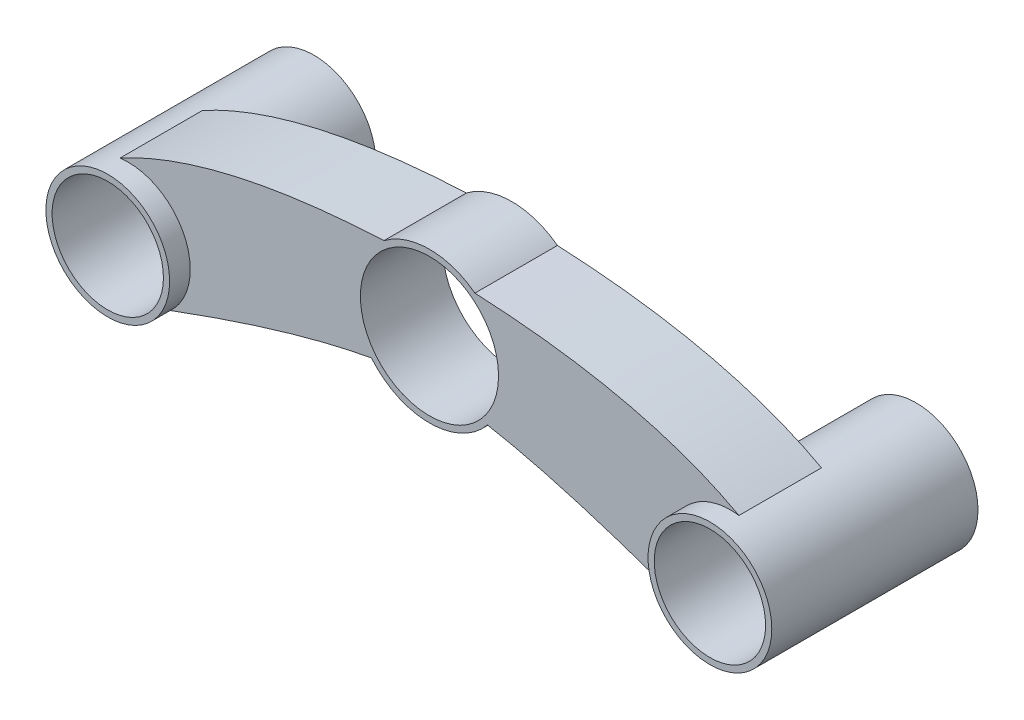
ISO-10303-21;
HEADER;
FILE_DESCRIPTION(('STEP AP214'),'2;1');
FILE_NAME('part.step','',(''),(''),'','','');
FILE_SCHEMA(('AUTOMOTIVE_DESIGN { 1 0 10303 214 1 1 1 1 }'));
ENDSEC;
DATA;
#1=APPLICATION_CONTEXT('core data for automotive mechanical design processes');
#2=APPLICATION_PROTOCOL_DEFINITION('international standard','automotive_design',2000,#1);
#3=PRODUCT_CONTEXT('',#1,'mechanical');
#4=PRODUCT('Part','Part','',(#3));
#5=PRODUCT_RELATED_PRODUCT_CATEGORY('part','',(#4));
#6=PRODUCT_DEFINITION_FORMATION('','',#4);
#7=PRODUCT_DEFINITION_CONTEXT('part definition',#1,'design');
#8=PRODUCT_DEFINITION('design','',#6,#7);
#9=PRODUCT_DEFINITION_SHAPE('','',#8);
#10=(LENGTH_UNIT() NAMED_UNIT(*) SI_UNIT(.MILLI.,.METRE.));
#11=(NAMED_UNIT(*) PLANE_ANGLE_UNIT() SI_UNIT($,.RADIAN.));
#12=(NAMED_UNIT(*) SI_UNIT($,.STERADIAN.) SOLID_ANGLE_UNIT());
#13=UNCERTAINTY_MEASURE_WITH_UNIT(LENGTH_MEASURE(1.E-05),#10,'distance_accuracy_value','');
#14=(GEOMETRIC_REPRESENTATION_CONTEXT(3) GLOBAL_UNCERTAINTY_ASSIGNED_CONTEXT((#13)) GLOBAL_UNIT_ASSIGNED_CONTEXT((#10,
#11,#12)) REPRESENTATION_CONTEXT('',''));
#15=CARTESIAN_POINT('',(0.,0.,0.));
#16=DIRECTION('',(0.,0.,1.));
#17=DIRECTION('',(1.,0.,0.));
#18=AXIS2_PLACEMENT_3D('',#15,#16,#17);
#19=CARTESIAN_POINT('',(120.37838915768,24.9105220402236,45.));
#20=DIRECTION('',(0.,0.,-1.));
#21=DIRECTION('',(-1.,0.,0.));
#22=AXIS2_PLACEMENT_3D('',#19,#20,#21);
#23=PLANE('',#22);
#24=CARTESIAN_POINT('',(148.041829409571,14.8603813094486,45.));
#25=CARTESIAN_POINT('',(124.7234173012,27.6190888058887,45.));
#26=CARTESIAN_POINT('',(84.0248926187476,29.5435292396682,45.));
#27=B_SPLINE_CURVE_WITH_KNOTS('',2,(#24,#25,#26),.UNSPECIFIED.,.F.,.F.,(3,3),(0.,1.),.UNSPECIFIED.);
#28=CARTESIAN_POINT('',(148.041829409571,14.8603813094486,45.));
#29=VERTEX_POINT('',#28);
#30=CARTESIAN_POINT('',(84.0248926187476,29.5435292396682,45.));
#31=VERTEX_POINT('',#30);
#32=EDGE_CURVE('E215',#29,#31,#27,.T.);
#33=ORIENTED_EDGE('',*,*,#32,.T.);
#34=CARTESIAN_POINT('',(73.,15.,45.));
#35=DIRECTION('',(0.,0.,1.));
#36=DIRECTION('',(1.,0.,0.));
#37=AXIS2_PLACEMENT_3D('',#34,#35,#36);
#38=CIRCLE('',#37,18.25);
#39=CARTESIAN_POINT('',(61.9751073812524,29.5435292396682,45.));
#40=VERTEX_POINT('',#39);
#41=EDGE_CURVE('E107',#31,#40,#38,.T.);
#42=ORIENTED_EDGE('',*,*,#41,.T.);
#43=CARTESIAN_POINT('',(61.9751073812524,29.5435292396682,45.));
#44=CARTESIAN_POINT('',(21.2765826988004,27.6190888058887,45.));
#45=CARTESIAN_POINT('',(-2.04182940957121,14.8603813094486,45.));
#46=B_SPLINE_CURVE_WITH_KNOTS('',2,(#43,#44,#45),.UNSPECIFIED.,.F.,.F.,(3,3),(0.,1.),.UNSPECIFIED.);
#47=CARTESIAN_POINT('',(-2.04182940957121,14.8603813094486,45.));
#48=VERTEX_POINT('',#47);
#49=EDGE_CURVE('E173',#40,#48,#46,.T.);
#50=ORIENTED_EDGE('',*,*,#49,.T.);
#51=CARTESIAN_POINT('',(0.,0.,45.));
#52=DIRECTION('',(0.,0.,-1.));
#53=DIRECTION('',(1.,0.,0.));
#54=AXIS2_PLACEMENT_3D('',#51,#52,#53);
#55=CIRCLE('',#54,15.);
#56=CARTESIAN_POINT('',(10.1419257855149,-11.0517573879048,45.));
#57=VERTEX_POINT('',#56);
#58=EDGE_CURVE('E168',#48,#57,#55,.T.);
#59=ORIENTED_EDGE('',*,*,#58,.T.);
#60=CARTESIAN_POINT('',(10.1419257855149,-11.0517573879048,45.));
#61=CARTESIAN_POINT('',(39.606342857875,-0.108887447388188,45.));
#62=CARTESIAN_POINT('',(58.9300484309368,3.37679205880679,45.));
#63=B_SPLINE_CURVE_WITH_KNOTS('',2,(#60,#61,#62),.UNSPECIFIED.,.F.,.F.,(3,3),(0.,1.),.UNSPECIFIED.);
#64=CARTESIAN_POINT('',(58.9300484309368,3.37679205880679,45.));
#65=VERTEX_POINT('',#64);
#66=EDGE_CURVE('E126',#57,#65,#63,.T.);
#67=ORIENTED_EDGE('',*,*,#66,.T.);
#68=CARTESIAN_POINT('',(73.,15.,45.));
#69=DIRECTION('',(0.,0.,1.));
#70=DIRECTION('',(1.,0.,0.));
#71=AXIS2_PLACEMENT_3D('',#68,#69,#70);
#72=CIRCLE('',#71,18.25);
#73=CARTESIAN_POINT('',(87.0699515690632,3.37679205880679,45.));
#74=VERTEX_POINT('',#73);
#75=EDGE_CURVE('E120',#65,#74,#72,.T.);
#76=ORIENTED_EDGE('',*,*,#75,.T.);
#77=CARTESIAN_POINT('',(87.0699515690632,3.37679205880679,45.));
#78=CARTESIAN_POINT('',(106.393657142125,-0.108887447388181,45.));
#79=CARTESIAN_POINT('',(135.858074214485,-11.0517573879048,45.));
#80=B_SPLINE_CURVE_WITH_KNOTS('',2,(#77,#78,#79),.UNSPECIFIED.,.F.,.F.,(3,3),(0.,1.),.UNSPECIFIED.);
#81=CARTESIAN_POINT('',(135.858074214485,-11.0517573879048,45.));
#82=VERTEX_POINT('',#81);
#83=EDGE_CURVE('E124',#74,#82,#80,.T.);
#84=ORIENTED_EDGE('',*,*,#83,.T.);
#85=CARTESIAN_POINT('',(146.,0.,45.));
#86=DIRECTION('',(0.,0.,-1.));
#87=DIRECTION('',(-1.,0.,0.));
#88=AXIS2_PLACEMENT_3D('',#85,#86,#87);
#89=CIRCLE('',#88,15.);
#90=EDGE_CURVE('E64',#82,#29,#89,.T.);
#91=ORIENTED_EDGE('',*,*,#90,.T.);
#92=EDGE_LOOP('',(#33,#42,#50,#59,#67,#76,#84,#91));
#93=FACE_BOUND('',#92,.T.);
#94=CARTESIAN_POINT('',(73.,15.,45.));
#95=DIRECTION('',(0.,0.,1.));
#96=DIRECTION('',(1.,0.,0.));
#97=AXIS2_PLACEMENT_3D('',#94,#95,#96);
#98=CIRCLE('',#97,16.75);
#99=CARTESIAN_POINT('',(89.75,15.,45.));
#100=VERTEX_POINT('',#99);
#101=EDGE_CURVE('E207',#100,#100,#98,.T.);
#102=ORIENTED_EDGE('',*,*,#101,.F.);
#103=EDGE_LOOP('',(#102));
#104=FACE_BOUND('',#103,.T.);
#105=ADVANCED_FACE('F46',(#93,#104),#23,.F.);
#106=CARTESIAN_POINT('',(120.37838915768,24.9105220402236,25.));
#107=DIRECTION('',(0.,0.,-1.));
#108=DIRECTION('',(-1.,0.,0.));
#109=AXIS2_PLACEMENT_3D('',#106,#107,#108);
#110=PLANE('',#109);
#111=CARTESIAN_POINT('',(148.041829409571,14.8603813094486,25.));
#112=CARTESIAN_POINT('',(124.7234173012,27.6190888058887,25.));
#113=CARTESIAN_POINT('',(84.0248926187476,29.5435292396682,25.));
#114=B_SPLINE_CURVE_WITH_KNOTS('',2,(#111,#112,#113),.UNSPECIFIED.,.F.,.F.,(3,3),(0.,1.),.UNSPECIFIED.);
#115=CARTESIAN_POINT('',(148.041829409571,14.8603813094486,25.));
#116=VERTEX_POINT('',#115);
#117=CARTESIAN_POINT('',(84.0248926187476,29.5435292396682,25.));
#118=VERTEX_POINT('',#117);
#119=EDGE_CURVE('E213',#116,#118,#114,.T.);
#120=ORIENTED_EDGE('',*,*,#119,.F.);
#121=CARTESIAN_POINT('',(146.,0.,25.));
#122=DIRECTION('',(0.,0.,-1.));
#123=DIRECTION('',(-1.,0.,0.));
#124=AXIS2_PLACEMENT_3D('',#121,#122,#123);
#125=CIRCLE('',#124,15.);
#126=CARTESIAN_POINT('',(135.858074214485,-11.0517573879048,25.));
#127=VERTEX_POINT('',#126);
#128=EDGE_CURVE('E99',#127,#116,#125,.T.);
#129=ORIENTED_EDGE('',*,*,#128,.F.);
#130=CARTESIAN_POINT('',(87.0699515690632,3.37679205880679,25.));
#131=CARTESIAN_POINT('',(106.393657142125,-0.108887447388181,25.));
#132=CARTESIAN_POINT('',(135.858074214485,-11.0517573879048,25.));
#133=B_SPLINE_CURVE_WITH_KNOTS('',2,(#130,#131,#132),.UNSPECIFIED.,.F.,.F.,(3,3),(0.,1.),.UNSPECIFIED.);
#134=CARTESIAN_POINT('',(87.0699515690632,3.37679205880679,25.));
#135=VERTEX_POINT('',#134);
#136=EDGE_CURVE('E93',#135,#127,#133,.T.);
#137=ORIENTED_EDGE('',*,*,#136,.F.);
#138=CARTESIAN_POINT('',(73.,15.,25.));
#139=DIRECTION('',(0.,0.,1.));
#140=DIRECTION('',(1.,0.,0.));
#141=AXIS2_PLACEMENT_3D('',#138,#139,#140);
#142=CIRCLE('',#141,18.25);
#143=CARTESIAN_POINT('',(58.9300484309368,3.37679205880679,25.));
#144=VERTEX_POINT('',#143);
#145=EDGE_CURVE('E134',#144,#135,#142,.T.);
#146=ORIENTED_EDGE('',*,*,#145,.F.);
#147=CARTESIAN_POINT('',(10.1419257855149,-11.0517573879048,25.));
#148=CARTESIAN_POINT('',(39.606342857875,-0.108887447388188,25.));
#149=CARTESIAN_POINT('',(58.9300484309368,3.37679205880679,25.));
#150=B_SPLINE_CURVE_WITH_KNOTS('',2,(#147,#148,#149),.UNSPECIFIED.,.F.,.F.,(3,3),(0.,1.),.UNSPECIFIED.);
#151=CARTESIAN_POINT('',(10.1419257855149,-11.0517573879048,25.));
#152=VERTEX_POINT('',#151);
#153=EDGE_CURVE('E249',#152,#144,#150,.T.);
#154=ORIENTED_EDGE('',*,*,#153,.F.);
#155=CARTESIAN_POINT('',(0.,0.,25.));
#156=DIRECTION('',(0.,0.,-1.));
#157=DIRECTION('',(1.,0.,0.));
#158=AXIS2_PLACEMENT_3D('',#155,#156,#157);
#159=CIRCLE('',#158,15.);
#160=CARTESIAN_POINT('',(-2.04182940957121,14.8603813094486,25.));
#161=VERTEX_POINT('',#160);
#162=EDGE_CURVE('E247',#161,#152,#159,.T.);
#163=ORIENTED_EDGE('',*,*,#162,.F.);
#164=CARTESIAN_POINT('',(61.9751073812524,29.5435292396682,25.));
#165=CARTESIAN_POINT('',(21.2765826988004,27.6190888058887,25.));
#166=CARTESIAN_POINT('',(-2.04182940957121,14.8603813094486,25.));
#167=B_SPLINE_CURVE_WITH_KNOTS('',2,(#164,#165,#166),.UNSPECIFIED.,.F.,.F.,(3,3),(0.,1.),.UNSPECIFIED.);
#168=CARTESIAN_POINT('',(61.9751073812524,29.5435292396682,25.));
#169=VERTEX_POINT('',#168);
#170=EDGE_CURVE('E242',#169,#161,#167,.T.);
#171=ORIENTED_EDGE('',*,*,#170,.F.);
#172=CARTESIAN_POINT('',(73.,15.,25.));
#173=DIRECTION('',(0.,0.,1.));
#174=DIRECTION('',(1.,0.,0.));
#175=AXIS2_PLACEMENT_3D('',#172,#173,#174);
#176=CIRCLE('',#175,18.25);
#177=EDGE_CURVE('E245',#118,#169,#176,.T.);
#178=ORIENTED_EDGE('',*,*,#177,.F.);
#179=EDGE_LOOP('',(#120,#129,#137,#146,#154,#163,#171,#178));
#180=FACE_BOUND('',#179,.T.);
#181=CARTESIAN_POINT('',(73.,15.,25.));
#182=DIRECTION('',(0.,0.,1.));
#183=DIRECTION('',(1.,0.,0.));
#184=AXIS2_PLACEMENT_3D('',#181,#182,#183);
#185=CIRCLE('',#184,16.75);
#186=CARTESIAN_POINT('',(89.75,15.,25.));
#187=VERTEX_POINT('',#186);
#188=EDGE_CURVE('E210',#187,#187,#185,.T.);
#189=ORIENTED_EDGE('',*,*,#188,.T.);
#190=EDGE_LOOP('',(#189));
#191=FACE_BOUND('',#190,.T.);
#192=ADVANCED_FACE('F189',(#180,#191),#110,.T.);
#193=DIRECTION('',(0.,0.,-1.));
#194=VECTOR('',#193,1.);
#195=SURFACE_OF_LINEAR_EXTRUSION('',#27,#194);
#196=ORIENTED_EDGE('',*,*,#119,.T.);
#197=DIRECTION('',(0.,0.,-1.));
#198=VECTOR('',#197,1.);
#199=CARTESIAN_POINT('',(84.0248926187476,29.5435292396682,45.));
#200=LINE('',#199,#198);
#201=EDGE_CURVE('E12',#31,#118,#200,.T.);
#202=ORIENTED_EDGE('',*,*,#201,.F.);
#203=ORIENTED_EDGE('',*,*,#32,.F.);
#204=DIRECTION('',(0.,0.,-1.));
#205=VECTOR('',#204,1.);
#206=CARTESIAN_POINT('',(148.041829409571,14.8603813094486,45.));
#207=LINE('',#206,#205);
#208=EDGE_CURVE('E140',#29,#116,#207,.T.);
#209=ORIENTED_EDGE('',*,*,#208,.T.);
#210=EDGE_LOOP('',(#196,#202,#203,#209));
#211=FACE_BOUND('',#210,.T.);
#212=ADVANCED_FACE('F48',(#211),#195,.F.);
#213=CARTESIAN_POINT('',(73.,15.,45.));
#214=DIRECTION('',(0.,0.,-1.));
#215=DIRECTION('',(-1.,0.,0.));
#216=AXIS2_PLACEMENT_3D('',#213,#214,#215);
#217=CYLINDRICAL_SURFACE('',#216,18.25);
#218=ORIENTED_EDGE('',*,*,#177,.T.);
#219=DIRECTION('',(0.,0.,-1.));
#220=VECTOR('',#219,1.);
#221=CARTESIAN_POINT('',(61.9751073812524,29.5435292396682,45.));
#222=LINE('',#221,#220);
#223=EDGE_CURVE('E56',#40,#169,#222,.T.);
#224=ORIENTED_EDGE('',*,*,#223,.F.);
#225=ORIENTED_EDGE('',*,*,#41,.F.);
#226=ORIENTED_EDGE('',*,*,#201,.T.);
#227=EDGE_LOOP('',(#218,#224,#225,#226));
#228=FACE_BOUND('',#227,.T.);
#229=ADVANCED_FACE('F183',(#228),#217,.T.);
#230=DIRECTION('',(0.,0.,-1.));
#231=VECTOR('',#230,1.);
#232=SURFACE_OF_LINEAR_EXTRUSION('',#46,#231);
#233=ORIENTED_EDGE('',*,*,#170,.T.);
#234=DIRECTION('',(0.,0.,-1.));
#235=VECTOR('',#234,1.);
#236=CARTESIAN_POINT('',(-2.04182940957121,14.8603813094486,45.));
#237=LINE('',#236,#235);
#238=EDGE_CURVE('E236',#48,#161,#237,.T.);
#239=ORIENTED_EDGE('',*,*,#238,.F.);
#240=ORIENTED_EDGE('',*,*,#49,.F.);
#241=ORIENTED_EDGE('',*,*,#223,.T.);
#242=EDGE_LOOP('',(#233,#239,#240,#241));
#243=FACE_BOUND('',#242,.T.);
#244=ADVANCED_FACE('F181',(#243),#232,.F.);
#245=CARTESIAN_POINT('',(0.,0.,45.));
#246=DIRECTION('',(0.,0.,-1.));
#247=DIRECTION('',(-1.,0.,0.));
#248=AXIS2_PLACEMENT_3D('',#245,#246,#247);
#249=CYLINDRICAL_SURFACE('',#248,15.);
#250=ORIENTED_EDGE('',*,*,#162,.T.);
#251=DIRECTION('',(0.,0.,-1.));
#252=VECTOR('',#251,1.);
#253=CARTESIAN_POINT('',(10.1419257855149,-11.0517573879048,45.));
#254=LINE('',#253,#252);
#255=EDGE_CURVE('E233',#57,#152,#254,.T.);
#256=ORIENTED_EDGE('',*,*,#255,.F.);
#257=ORIENTED_EDGE('',*,*,#58,.F.);
#258=ORIENTED_EDGE('',*,*,#238,.T.);
#259=EDGE_LOOP('',(#250,#256,#257,#258));
#260=FACE_BOUND('',#259,.T.);
#261=ADVANCED_FACE('F161',(#260),#249,.F.);
#262=DIRECTION('',(0.,0.,-1.));
#263=VECTOR('',#262,1.);
#264=SURFACE_OF_LINEAR_EXTRUSION('',#63,#263);
#265=ORIENTED_EDGE('',*,*,#153,.T.);
#266=DIRECTION('',(0.,0.,-1.));
#267=VECTOR('',#266,1.);
#268=CARTESIAN_POINT('',(58.9300484309368,3.37679205880679,45.));
#269=LINE('',#268,#267);
#270=EDGE_CURVE('E135',#65,#144,#269,.T.);
#271=ORIENTED_EDGE('',*,*,#270,.F.);
#272=ORIENTED_EDGE('',*,*,#66,.F.);
#273=ORIENTED_EDGE('',*,*,#255,.T.);
#274=EDGE_LOOP('',(#265,#271,#272,#273));
#275=FACE_BOUND('',#274,.T.);
#276=ADVANCED_FACE('F158',(#275),#264,.F.);
#277=CARTESIAN_POINT('',(73.,15.,45.));
#278=DIRECTION('',(0.,0.,-1.));
#279=DIRECTION('',(-1.,0.,0.));
#280=AXIS2_PLACEMENT_3D('',#277,#278,#279);
#281=CYLINDRICAL_SURFACE('',#280,18.25);
#282=ORIENTED_EDGE('',*,*,#145,.T.);
#283=DIRECTION('',(0.,0.,-1.));
#284=VECTOR('',#283,1.);
#285=CARTESIAN_POINT('',(87.0699515690632,3.37679205880679,45.));
#286=LINE('',#285,#284);
#287=EDGE_CURVE('E131',#74,#135,#286,.T.);
#288=ORIENTED_EDGE('',*,*,#287,.F.);
#289=ORIENTED_EDGE('',*,*,#75,.F.);
#290=ORIENTED_EDGE('',*,*,#270,.T.);
#291=EDGE_LOOP('',(#282,#288,#289,#290));
#292=FACE_BOUND('',#291,.T.);
#293=ADVANCED_FACE('F132',(#292),#281,.T.);
#294=DIRECTION('',(0.,0.,-1.));
#295=VECTOR('',#294,1.);
#296=SURFACE_OF_LINEAR_EXTRUSION('',#80,#295);
#297=ORIENTED_EDGE('',*,*,#136,.T.);
#298=DIRECTION('',(0.,0.,-1.));
#299=VECTOR('',#298,1.);
#300=CARTESIAN_POINT('',(135.858074214485,-11.0517573879048,45.));
#301=LINE('',#300,#299);
#302=EDGE_CURVE('E136',#82,#127,#301,.T.);
#303=ORIENTED_EDGE('',*,*,#302,.F.);
#304=ORIENTED_EDGE('',*,*,#83,.F.);
#305=ORIENTED_EDGE('',*,*,#287,.T.);
#306=EDGE_LOOP('',(#297,#303,#304,#305));
#307=FACE_BOUND('',#306,.T.);
#308=ADVANCED_FACE('F138',(#307),#296,.F.);
#309=CARTESIAN_POINT('',(146.,0.,45.));
#310=DIRECTION('',(0.,0.,-1.));
#311=DIRECTION('',(-1.,0.,0.));
#312=AXIS2_PLACEMENT_3D('',#309,#310,#311);
#313=CYLINDRICAL_SURFACE('',#312,15.);
#314=ORIENTED_EDGE('',*,*,#128,.T.);
#315=ORIENTED_EDGE('',*,*,#208,.F.);
#316=ORIENTED_EDGE('',*,*,#90,.F.);
#317=ORIENTED_EDGE('',*,*,#302,.T.);
#318=EDGE_LOOP('',(#314,#315,#316,#317));
#319=FACE_BOUND('',#318,.T.);
#320=ADVANCED_FACE('F154',(#319),#313,.F.);
#321=CARTESIAN_POINT('',(73.,15.,45.));
#322=DIRECTION('',(0.,0.,-1.));
#323=DIRECTION('',(-1.,0.,0.));
#324=AXIS2_PLACEMENT_3D('',#321,#322,#323);
#325=CYLINDRICAL_SURFACE('',#324,16.75);
#326=ORIENTED_EDGE('',*,*,#101,.T.);
#327=EDGE_LOOP('',(#326));
#328=FACE_BOUND('',#327,.T.);
#329=ORIENTED_EDGE('',*,*,#188,.F.);
#330=EDGE_LOOP('',(#329));
#331=FACE_BOUND('',#330,.T.);
#332=ADVANCED_FACE('F198',(#328,#331),#325,.F.);
#333=CLOSED_SHELL('',(#105,#192,#212,#229,#244,#261,#276,#293,#308,#320,#332));
#334=MANIFOLD_SOLID_BREP('B2',#333);
#335=CARTESIAN_POINT('',(146.,0.,50.));
#336=DIRECTION('',(0.,0.,1.));
#337=DIRECTION('',(1.,0.,0.));
#338=AXIS2_PLACEMENT_3D('',#335,#336,#337);
#339=PLANE('',#338);
#340=CARTESIAN_POINT('',(146.,0.,50.));
#341=DIRECTION('',(0.,0.,1.));
#342=DIRECTION('',(1.,0.,0.));
#343=AXIS2_PLACEMENT_3D('',#340,#341,#342);
#344=CIRCLE('',#343,15.);
#345=CARTESIAN_POINT('',(161.,0.,50.));
#346=VERTEX_POINT('',#345);
#347=EDGE_CURVE('E381',#346,#346,#344,.T.);
#348=ORIENTED_EDGE('',*,*,#347,.T.);
#349=EDGE_LOOP('',(#348));
#350=FACE_BOUND('',#349,.T.);
#351=CARTESIAN_POINT('',(146.,0.,50.));
#352=DIRECTION('',(0.,0.,1.));
#353=DIRECTION('',(1.,0.,0.));
#354=AXIS2_PLACEMENT_3D('',#351,#352,#353);
#355=CIRCLE('',#354,13.5);
#356=CARTESIAN_POINT('',(159.5,0.,50.));
#357=VERTEX_POINT('',#356);
#358=EDGE_CURVE('E372',#357,#357,#355,.T.);
#359=ORIENTED_EDGE('',*,*,#358,.F.);
#360=EDGE_LOOP('',(#359));
#361=FACE_BOUND('',#360,.T.);
#362=ADVANCED_FACE('F368',(#350,#361),#339,.T.);
#363=CARTESIAN_POINT('',(146.,0.,0.));
#364=DIRECTION('',(0.,0.,1.));
#365=DIRECTION('',(1.,0.,0.));
#366=AXIS2_PLACEMENT_3D('',#363,#364,#365);
#367=PLANE('',#366);
#368=CARTESIAN_POINT('',(146.,0.,0.));
#369=DIRECTION('',(0.,0.,1.));
#370=DIRECTION('',(1.,0.,0.));
#371=AXIS2_PLACEMENT_3D('',#368,#369,#370);
#372=CIRCLE('',#371,15.);
#373=CARTESIAN_POINT('',(161.,0.,0.));
#374=VERTEX_POINT('',#373);
#375=EDGE_CURVE('E379',#374,#374,#372,.T.);
#376=ORIENTED_EDGE('',*,*,#375,.F.);
#377=EDGE_LOOP('',(#376));
#378=FACE_BOUND('',#377,.T.);
#379=CARTESIAN_POINT('',(146.,0.,0.));
#380=DIRECTION('',(0.,0.,1.));
#381=DIRECTION('',(1.,0.,0.));
#382=AXIS2_PLACEMENT_3D('',#379,#380,#381);
#383=CIRCLE('',#382,13.5);
#384=CARTESIAN_POINT('',(159.5,0.,0.));
#385=VERTEX_POINT('',#384);
#386=EDGE_CURVE('E45',#385,#385,#383,.T.);
#387=ORIENTED_EDGE('',*,*,#386,.T.);
#388=EDGE_LOOP('',(#387));
#389=FACE_BOUND('',#388,.T.);
#390=ADVANCED_FACE('F389',(#378,#389),#367,.F.);
#391=CARTESIAN_POINT('',(146.,0.,50.));
#392=DIRECTION('',(0.,0.,-1.));
#393=DIRECTION('',(-1.,0.,0.));
#394=AXIS2_PLACEMENT_3D('',#391,#392,#393);
#395=CYLINDRICAL_SURFACE('',#394,15.);
#396=ORIENTED_EDGE('',*,*,#347,.F.);
#397=EDGE_LOOP('',(#396));
#398=FACE_BOUND('',#397,.T.);
#399=ORIENTED_EDGE('',*,*,#375,.T.);
#400=EDGE_LOOP('',(#399));
#401=FACE_BOUND('',#400,.T.);
#402=ADVANCED_FACE('F387',(#398,#401),#395,.T.);
#403=CARTESIAN_POINT('',(146.,0.,50.));
#404=DIRECTION('',(0.,0.,-1.));
#405=DIRECTION('',(-1.,0.,0.));
#406=AXIS2_PLACEMENT_3D('',#403,#404,#405);
#407=CYLINDRICAL_SURFACE('',#406,13.5);
#408=ORIENTED_EDGE('',*,*,#358,.T.);
#409=EDGE_LOOP('',(#408));
#410=FACE_BOUND('',#409,.T.);
#411=ORIENTED_EDGE('',*,*,#386,.F.);
#412=EDGE_LOOP('',(#411));
#413=FACE_BOUND('',#412,.T.);
#414=ADVANCED_FACE('F370',(#410,#413),#407,.F.);
#415=CLOSED_SHELL('',(#362,#390,#402,#414));
#416=MANIFOLD_SOLID_BREP('B6',#415);
#417=CARTESIAN_POINT('',(0.,0.,50.));
#418=DIRECTION('',(0.,0.,1.));
#419=DIRECTION('',(1.,0.,0.));
#420=AXIS2_PLACEMENT_3D('',#417,#418,#419);
#421=PLANE('',#420);
#422=CARTESIAN_POINT('',(0.,0.,50.));
#423=DIRECTION('',(0.,0.,1.));
#424=DIRECTION('',(1.,0.,0.));
#425=AXIS2_PLACEMENT_3D('',#422,#423,#424);
#426=CIRCLE('',#425,15.);
#427=CARTESIAN_POINT('',(15.,0.,50.));
#428=VERTEX_POINT('',#427);
#429=EDGE_CURVE('E367',#428,#428,#426,.T.);
#430=ORIENTED_EDGE('',*,*,#429,.T.);
#431=EDGE_LOOP('',(#430));
#432=FACE_BOUND('',#431,.T.);
#433=CARTESIAN_POINT('',(0.,0.,50.));
#434=DIRECTION('',(0.,0.,1.));
#435=DIRECTION('',(1.,0.,0.));
#436=AXIS2_PLACEMENT_3D('',#433,#434,#435);
#437=CIRCLE('',#436,13.5);
#438=CARTESIAN_POINT('',(13.5,0.,50.));
#439=VERTEX_POINT('',#438);
#440=EDGE_CURVE('E449',#439,#439,#437,.T.);
#441=ORIENTED_EDGE('',*,*,#440,.F.);
#442=EDGE_LOOP('',(#441));
#443=FACE_BOUND('',#442,.T.);
#444=ADVANCED_FACE('F438',(#432,#443),#421,.T.);
#445=CARTESIAN_POINT('',(0.,0.,0.));
#446=DIRECTION('',(0.,0.,1.));
#447=DIRECTION('',(1.,0.,0.));
#448=AXIS2_PLACEMENT_3D('',#445,#446,#447);
#449=PLANE('',#448);
#450=CARTESIAN_POINT('',(0.,0.,0.));
#451=DIRECTION('',(0.,0.,1.));
#452=DIRECTION('',(1.,0.,0.));
#453=AXIS2_PLACEMENT_3D('',#450,#451,#452);
#454=CIRCLE('',#453,15.);
#455=CARTESIAN_POINT('',(15.,0.,0.));
#456=VERTEX_POINT('',#455);
#457=EDGE_CURVE('E442',#456,#456,#454,.T.);
#458=ORIENTED_EDGE('',*,*,#457,.F.);
#459=EDGE_LOOP('',(#458));
#460=FACE_BOUND('',#459,.T.);
#461=CARTESIAN_POINT('',(0.,0.,0.));
#462=DIRECTION('',(0.,0.,1.));
#463=DIRECTION('',(1.,0.,0.));
#464=AXIS2_PLACEMENT_3D('',#461,#462,#463);
#465=CIRCLE('',#464,13.5);
#466=CARTESIAN_POINT('',(13.5,0.,0.));
#467=VERTEX_POINT('',#466);
#468=EDGE_CURVE('E451',#467,#467,#465,.T.);
#469=ORIENTED_EDGE('',*,*,#468,.T.);
#470=EDGE_LOOP('',(#469));
#471=FACE_BOUND('',#470,.T.);
#472=ADVANCED_FACE('F461',(#460,#471),#449,.F.);
#473=CARTESIAN_POINT('',(0.,0.,50.));
#474=DIRECTION('',(0.,0.,-1.));
#475=DIRECTION('',(-1.,0.,0.));
#476=AXIS2_PLACEMENT_3D('',#473,#474,#475);
#477=CYLINDRICAL_SURFACE('',#476,15.);
#478=ORIENTED_EDGE('',*,*,#429,.F.);
#479=EDGE_LOOP('',(#478));
#480=FACE_BOUND('',#479,.T.);
#481=ORIENTED_EDGE('',*,*,#457,.T.);
#482=EDGE_LOOP('',(#481));
#483=FACE_BOUND('',#482,.T.);
#484=ADVANCED_FACE('F440',(#480,#483),#477,.T.);
#485=CARTESIAN_POINT('',(0.,0.,50.));
#486=DIRECTION('',(0.,0.,-1.));
#487=DIRECTION('',(-1.,0.,0.));
#488=AXIS2_PLACEMENT_3D('',#485,#486,#487);
#489=CYLINDRICAL_SURFACE('',#488,13.5);
#490=ORIENTED_EDGE('',*,*,#440,.T.);
#491=EDGE_LOOP('',(#490));
#492=FACE_BOUND('',#491,.T.);
#493=ORIENTED_EDGE('',*,*,#468,.F.);
#494=EDGE_LOOP('',(#493));
#495=FACE_BOUND('',#494,.T.);
#496=ADVANCED_FACE('F457',(#492,#495),#489,.F.);
#497=CLOSED_SHELL('',(#444,#472,#484,#496));
#498=MANIFOLD_SOLID_BREP('B40',#497);
#499=ADVANCED_BREP_SHAPE_REPRESENTATION('',(#18,#334,#416,#498),#14);
#500=SHAPE_DEFINITION_REPRESENTATION(#9,#499);
ENDSEC;
END-ISO-10303-21;
